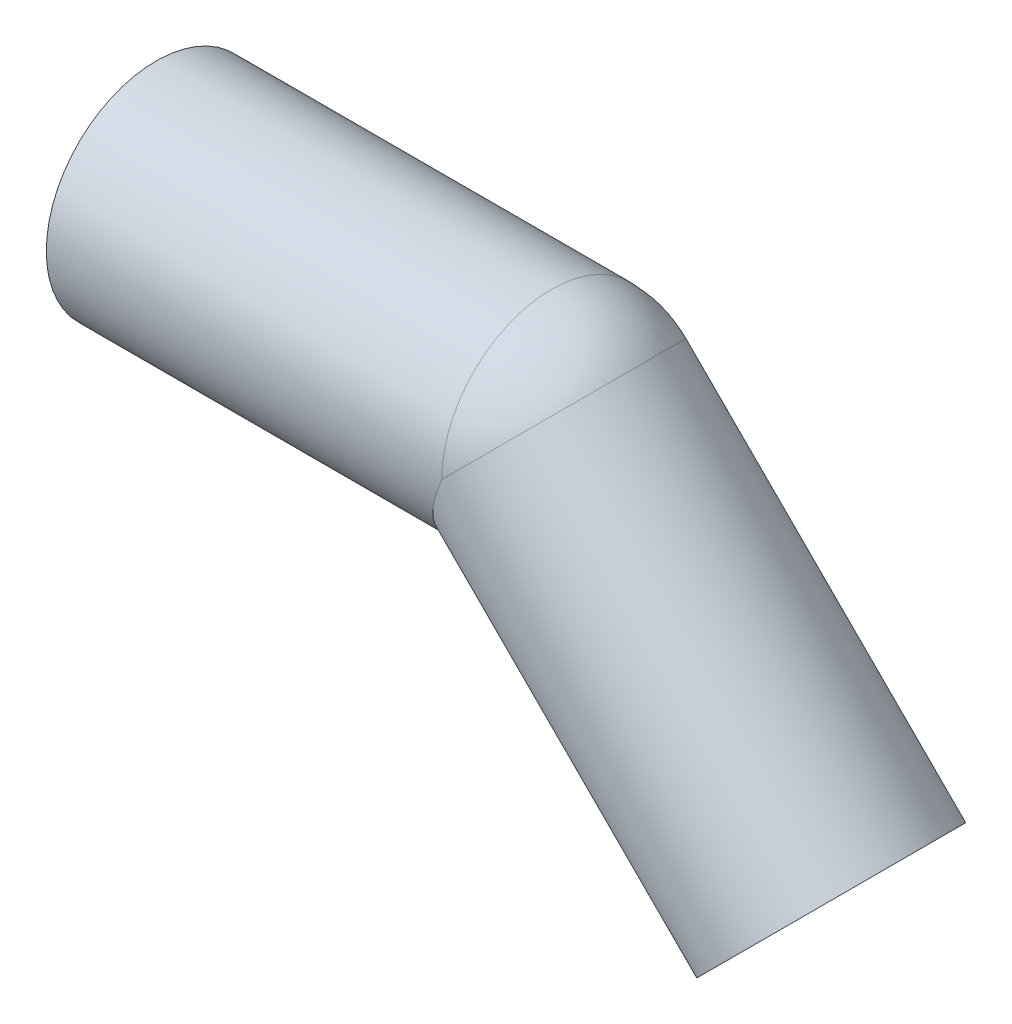
ISO-10303-21;
HEADER;
FILE_DESCRIPTION(('STEP AP214'),'2;1');
FILE_NAME('part.step','',(''),(''),'','','');
FILE_SCHEMA(('AUTOMOTIVE_DESIGN { 1 0 10303 214 1 1 1 1 }'));
ENDSEC;
DATA;
#1=APPLICATION_CONTEXT('core data for automotive mechanical design processes');
#2=APPLICATION_PROTOCOL_DEFINITION('international standard','automotive_design',2000,#1);
#3=PRODUCT_CONTEXT('',#1,'mechanical');
#4=PRODUCT('Part','Part','',(#3));
#5=PRODUCT_RELATED_PRODUCT_CATEGORY('part','',(#4));
#6=PRODUCT_DEFINITION_FORMATION('','',#4);
#7=PRODUCT_DEFINITION_CONTEXT('part definition',#1,'design');
#8=PRODUCT_DEFINITION('design','',#6,#7);
#9=PRODUCT_DEFINITION_SHAPE('','',#8);
#10=(LENGTH_UNIT() NAMED_UNIT(*) SI_UNIT(.MILLI.,.METRE.));
#11=(NAMED_UNIT(*) PLANE_ANGLE_UNIT() SI_UNIT($,.RADIAN.));
#12=(NAMED_UNIT(*) SI_UNIT($,.STERADIAN.) SOLID_ANGLE_UNIT());
#13=UNCERTAINTY_MEASURE_WITH_UNIT(LENGTH_MEASURE(1.E-05),#10,'distance_accuracy_value','');
#14=(GEOMETRIC_REPRESENTATION_CONTEXT(3) GLOBAL_UNCERTAINTY_ASSIGNED_CONTEXT((#13)) GLOBAL_UNIT_ASSIGNED_CONTEXT((#10,
#11,#12)) REPRESENTATION_CONTEXT('',''));
#15=CARTESIAN_POINT('',(0.,0.,0.));
#16=DIRECTION('',(0.,0.,1.));
#17=DIRECTION('',(1.,0.,0.));
#18=AXIS2_PLACEMENT_3D('',#15,#16,#17);
#19=CARTESIAN_POINT('',(76.8198051533945,-31.8198051533949,0.));
#20=DIRECTION('',(-0.70710678118654,0.707106781186555,0.));
#21=DIRECTION('',(-0.707106781186555,-0.70710678118654,0.));
#22=AXIS2_PLACEMENT_3D('',#19,#20,#21);
#23=CYLINDRICAL_SURFACE('',#22,10.6);
#24=CARTESIAN_POINT('',(45.,0.,0.));
#25=DIRECTION('',(0.707106781186547,-0.707106781186548,0.));
#26=DIRECTION('',(0.,0.,-1.));
#27=AXIS2_PLACEMENT_3D('',#24,#25,#26);
#28=CIRCLE('',#27,10.6);
#29=CARTESIAN_POINT('',(52.4953318809489,7.49533188020596,0.));
#30=VERTEX_POINT('',#29);
#31=CARTESIAN_POINT('',(45.0000000000002,-1.07196793468043E-13,10.6));
#32=VERTEX_POINT('',#31);
#33=EDGE_CURVE('E53',#30,#32,#28,.T.);
#34=ORIENTED_EDGE('',*,*,#33,.F.);
#35=CARTESIAN_POINT('',(45.,0.,0.));
#36=DIRECTION('',(0.707106781081423,-0.707106781291672,0.));
#37=DIRECTION('',(0.,0.,-1.));
#38=AXIS2_PLACEMENT_3D('',#35,#36,#37);
#39=CIRCLE('',#38,10.6);
#40=CARTESIAN_POINT('',(45.0000000000003,-1.15468951267044E-13,-10.6));
#41=VERTEX_POINT('',#40);
#42=EDGE_CURVE('E46',#41,#30,#39,.T.);
#43=ORIENTED_EDGE('',*,*,#42,.F.);
#44=CARTESIAN_POINT('',(45.0000000000003,0.,0.));
#45=DIRECTION('',(-0.923879532511285,0.382683432365095,0.));
#46=DIRECTION('',(-0.382683432365095,-0.923879532511285,0.));
#47=AXIS2_PLACEMENT_3D('',#44,#45,#46);
#48=ELLIPSE('',#47,11.4733573230994,10.6);
#49=EDGE_CURVE('E55',#32,#41,#48,.F.);
#50=ORIENTED_EDGE('',*,*,#49,.F.);
#51=EDGE_LOOP('',(#34,#43,#50));
#52=FACE_BOUND('',#51,.T.);
#53=CARTESIAN_POINT('',(76.8198051533943,-31.8198051533947,0.));
#54=DIRECTION('',(-0.70710678118654,0.707106781186555,0.));
#55=DIRECTION('',(-0.707106781186555,-0.70710678118654,0.));
#56=AXIS2_PLACEMENT_3D('',#53,#54,#55);
#57=CIRCLE('',#56,10.6);
#58=CARTESIAN_POINT('',(69.3244732728168,-39.3151370339721,0.));
#59=VERTEX_POINT('',#58);
#60=EDGE_CURVE('E18',#59,#59,#57,.T.);
#61=ORIENTED_EDGE('',*,*,#60,.F.);
#62=EDGE_LOOP('',(#61));
#63=FACE_BOUND('',#62,.T.);
#64=ADVANCED_FACE('F15',(#52,#63),#23,.F.);
#65=CARTESIAN_POINT('',(45.,0.,0.));
#66=DIRECTION('',(0.,0.,1.));
#67=DIRECTION('',(-1.,0.,0.));
#68=AXIS2_PLACEMENT_3D('',#65,#66,#67);
#69=SPHERICAL_SURFACE('',#68,10.6);
#70=CARTESIAN_POINT('',(45.,0.,0.));
#71=DIRECTION('',(-1.,0.,0.));
#72=DIRECTION('',(0.,1.,0.));
#73=AXIS2_PLACEMENT_3D('',#70,#71,#72);
#74=CIRCLE('',#73,10.6);
#75=EDGE_CURVE('E51',#41,#32,#74,.F.);
#76=ORIENTED_EDGE('',*,*,#75,.F.);
#77=ORIENTED_EDGE('',*,*,#42,.T.);
#78=ORIENTED_EDGE('',*,*,#33,.T.);
#79=EDGE_LOOP('',(#76,#77,#78));
#80=FACE_BOUND('',#79,.T.);
#81=ADVANCED_FACE('F58',(#80),#69,.F.);
#82=CARTESIAN_POINT('',(85.6586399182278,-22.9809703885614,12.6500021083315));
#83=DIRECTION('',(0.707106781186547,-0.707106781186548,0.));
#84=DIRECTION('',(-0.707106781186548,-0.707106781186547,0.));
#85=AXIS2_PLACEMENT_3D('',#82,#83,#84);
#86=PLANE('',#85);
#87=ORIENTED_EDGE('',*,*,#60,.T.);
#88=EDGE_LOOP('',(#87));
#89=FACE_BOUND('',#88,.T.);
#90=CARTESIAN_POINT('',(76.8198051533941,-31.8198051533948,0.));
#91=DIRECTION('',(-0.707106781186532,0.707106781186563,0.));
#92=DIRECTION('',(-0.707106781186563,-0.707106781186532,0.));
#93=AXIS2_PLACEMENT_3D('',#90,#91,#92);
#94=CIRCLE('',#93,12.5);
#95=CARTESIAN_POINT('',(67.980970388562,-40.6586399182265,0.));
#96=VERTEX_POINT('',#95);
#97=EDGE_CURVE('E71',#96,#96,#94,.T.);
#98=ORIENTED_EDGE('',*,*,#97,.F.);
#99=EDGE_LOOP('',(#98));
#100=FACE_BOUND('',#99,.T.);
#101=ADVANCED_FACE('F80',(#89,#100),#86,.T.);
#102=CARTESIAN_POINT('',(45.,0.,0.));
#103=DIRECTION('',(-1.,0.,0.));
#104=DIRECTION('',(0.,0.,1.));
#105=AXIS2_PLACEMENT_3D('',#102,#103,#104);
#106=CYLINDRICAL_SURFACE('',#105,10.6);
#107=CARTESIAN_POINT('',(0.,0.,0.));
#108=DIRECTION('',(-1.,0.,0.));
#109=DIRECTION('',(0.,0.,1.));
#110=AXIS2_PLACEMENT_3D('',#107,#108,#109);
#111=CIRCLE('',#110,10.6);
#112=CARTESIAN_POINT('',(0.,0.,10.6));
#113=VERTEX_POINT('',#112);
#114=EDGE_CURVE('E68',#113,#113,#111,.F.);
#115=ORIENTED_EDGE('',*,*,#114,.F.);
#116=EDGE_LOOP('',(#115));
#117=FACE_BOUND('',#116,.T.);
#118=ORIENTED_EDGE('',*,*,#49,.T.);
#119=ORIENTED_EDGE('',*,*,#75,.T.);
#120=EDGE_LOOP('',(#118,#119));
#121=FACE_BOUND('',#120,.T.);
#122=ADVANCED_FACE('F83',(#117,#121),#106,.F.);
#123=CARTESIAN_POINT('',(45.,0.,0.));
#124=DIRECTION('',(0.,0.,1.));
#125=DIRECTION('',(1.,0.,0.));
#126=AXIS2_PLACEMENT_3D('',#123,#124,#125);
#127=SPHERICAL_SURFACE('',#126,12.5);
#128=CARTESIAN_POINT('',(45.,0.,0.));
#129=DIRECTION('',(-1.,0.,0.));
#130=DIRECTION('',(0.,1.,0.));
#131=AXIS2_PLACEMENT_3D('',#128,#129,#130);
#132=CIRCLE('',#131,12.5);
#133=CARTESIAN_POINT('',(45.0000000000005,-2.15515710602571E-13,12.5));
#134=VERTEX_POINT('',#133);
#135=CARTESIAN_POINT('',(45.0000000000005,-2.08607865924848E-13,-12.4999999999999));
#136=VERTEX_POINT('',#135);
#137=EDGE_CURVE('E67',#134,#136,#132,.T.);
#138=ORIENTED_EDGE('',*,*,#137,.F.);
#139=CARTESIAN_POINT('',(45.,0.,0.));
#140=DIRECTION('',(-0.707106781112542,0.707106781260553,0.));
#141=DIRECTION('',(0.,0.,1.));
#142=AXIS2_PLACEMENT_3D('',#139,#140,#141);
#143=CIRCLE('',#142,12.5);
#144=CARTESIAN_POINT('',(53.8388347652945,8.83883476436921,0.));
#145=VERTEX_POINT('',#144);
#146=EDGE_CURVE('E73',#134,#145,#143,.T.);
#147=ORIENTED_EDGE('',*,*,#146,.T.);
#148=CARTESIAN_POINT('',(45.0000000000003,3.19189119579733E-13,0.));
#149=DIRECTION('',(-0.707106781186533,0.707106781186562,0.));
#150=DIRECTION('',(0.707106781186562,0.707106781186533,0.));
#151=AXIS2_PLACEMENT_3D('',#148,#149,#150);
#152=CIRCLE('',#151,12.4999999999995);
#153=EDGE_CURVE('E33',#136,#145,#152,.F.);
#154=ORIENTED_EDGE('',*,*,#153,.F.);
#155=EDGE_LOOP('',(#138,#147,#154));
#156=FACE_BOUND('',#155,.T.);
#157=ADVANCED_FACE('F87',(#156),#127,.T.);
#158=CARTESIAN_POINT('',(45.0000000000003,3.13984949151802E-13,0.));
#159=DIRECTION('',(-0.707106781186532,0.707106781186563,0.));
#160=DIRECTION('',(-0.707106781186563,-0.707106781186532,0.));
#161=AXIS2_PLACEMENT_3D('',#158,#159,#160);
#162=CYLINDRICAL_SURFACE('',#161,12.5);
#163=ORIENTED_EDGE('',*,*,#97,.T.);
#164=EDGE_LOOP('',(#163));
#165=FACE_BOUND('',#164,.T.);
#166=CARTESIAN_POINT('',(45.0000000000006,0.,0.));
#167=DIRECTION('',(-0.923879532511283,0.3826834323651,0.));
#168=DIRECTION('',(-0.3826834323651,-0.923879532511283,0.));
#169=AXIS2_PLACEMENT_3D('',#166,#167,#168);
#170=ELLIPSE('',#169,13.529902503655,12.5);
#171=EDGE_CURVE('E24',#136,#134,#170,.T.);
#172=ORIENTED_EDGE('',*,*,#171,.F.);
#173=ORIENTED_EDGE('',*,*,#153,.T.);
#174=ORIENTED_EDGE('',*,*,#146,.F.);
#175=EDGE_LOOP('',(#172,#173,#174));
#176=FACE_BOUND('',#175,.T.);
#177=ADVANCED_FACE('F91',(#165,#176),#162,.T.);
#178=CARTESIAN_POINT('',(0.,-12.5,12.6500021083521));
#179=DIRECTION('',(-1.,0.,0.));
#180=DIRECTION('',(0.,1.,0.));
#181=AXIS2_PLACEMENT_3D('',#178,#179,#180);
#182=PLANE('',#181);
#183=ORIENTED_EDGE('',*,*,#114,.T.);
#184=EDGE_LOOP('',(#183));
#185=FACE_BOUND('',#184,.T.);
#186=CARTESIAN_POINT('',(0.,0.,0.));
#187=DIRECTION('',(-1.,0.,0.));
#188=DIRECTION('',(0.,0.,1.));
#189=AXIS2_PLACEMENT_3D('',#186,#187,#188);
#190=CIRCLE('',#189,12.5);
#191=CARTESIAN_POINT('',(0.,0.,12.5));
#192=VERTEX_POINT('',#191);
#193=EDGE_CURVE('E9',#192,#192,#190,.F.);
#194=ORIENTED_EDGE('',*,*,#193,.F.);
#195=EDGE_LOOP('',(#194));
#196=FACE_BOUND('',#195,.T.);
#197=ADVANCED_FACE('F105',(#185,#196),#182,.T.);
#198=CARTESIAN_POINT('',(0.,0.,0.));
#199=DIRECTION('',(-1.,0.,0.));
#200=DIRECTION('',(0.,0.,1.));
#201=AXIS2_PLACEMENT_3D('',#198,#199,#200);
#202=CYLINDRICAL_SURFACE('',#201,12.5);
#203=ORIENTED_EDGE('',*,*,#171,.T.);
#204=ORIENTED_EDGE('',*,*,#137,.T.);
#205=EDGE_LOOP('',(#203,#204));
#206=FACE_BOUND('',#205,.T.);
#207=ORIENTED_EDGE('',*,*,#193,.T.);
#208=EDGE_LOOP('',(#207));
#209=FACE_BOUND('',#208,.T.);
#210=ADVANCED_FACE('F102',(#206,#209),#202,.T.);
#211=CLOSED_SHELL('',(#64,#81,#101,#122,#157,#177,#197,#210));
#212=MANIFOLD_SOLID_BREP('B1',#211);
#213=ADVANCED_BREP_SHAPE_REPRESENTATION('',(#18,#212),#14);
#214=SHAPE_DEFINITION_REPRESENTATION(#9,#213);
ENDSEC;
END-ISO-10303-21;
